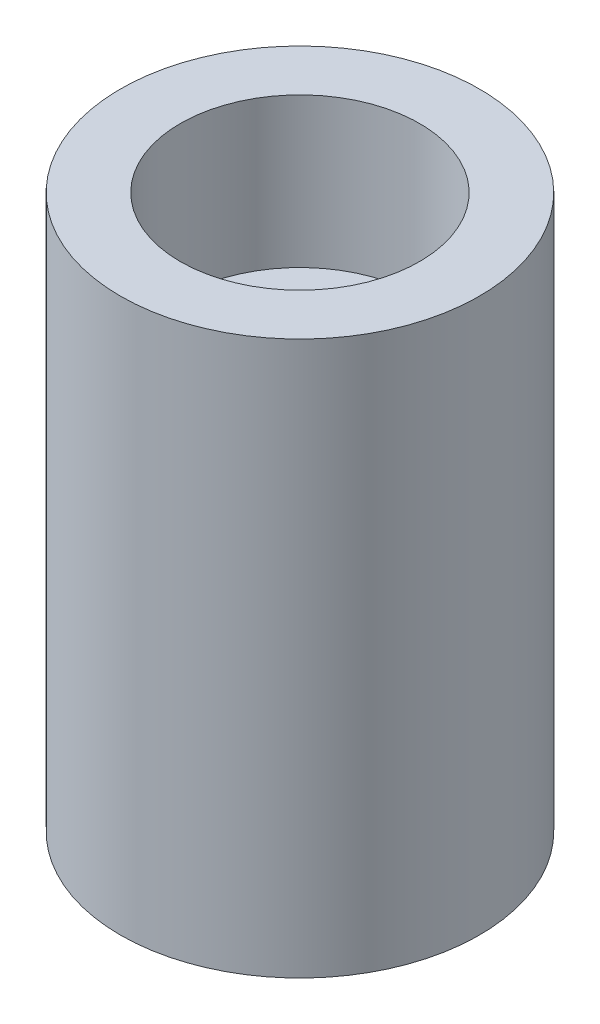
ISO-10303-21;
HEADER;
FILE_DESCRIPTION(('STEP AP214'),'2;1');
FILE_NAME('part.step','',(''),(''),'','','');
FILE_SCHEMA(('AUTOMOTIVE_DESIGN { 1 0 10303 214 1 1 1 1 }'));
ENDSEC;
DATA;
#1=APPLICATION_CONTEXT('core data for automotive mechanical design processes');
#2=APPLICATION_PROTOCOL_DEFINITION('international standard','automotive_design',2000,#1);
#3=PRODUCT_CONTEXT('',#1,'mechanical');
#4=PRODUCT('Part','Part','',(#3));
#5=PRODUCT_RELATED_PRODUCT_CATEGORY('part','',(#4));
#6=PRODUCT_DEFINITION_FORMATION('','',#4);
#7=PRODUCT_DEFINITION_CONTEXT('part definition',#1,'design');
#8=PRODUCT_DEFINITION('design','',#6,#7);
#9=PRODUCT_DEFINITION_SHAPE('','',#8);
#10=(LENGTH_UNIT() NAMED_UNIT(*) SI_UNIT(.MILLI.,.METRE.));
#11=(NAMED_UNIT(*) PLANE_ANGLE_UNIT() SI_UNIT($,.RADIAN.));
#12=(NAMED_UNIT(*) SI_UNIT($,.STERADIAN.) SOLID_ANGLE_UNIT());
#13=UNCERTAINTY_MEASURE_WITH_UNIT(LENGTH_MEASURE(1.E-05),#10,'distance_accuracy_value','');
#14=(GEOMETRIC_REPRESENTATION_CONTEXT(3) GLOBAL_UNCERTAINTY_ASSIGNED_CONTEXT((#13)) GLOBAL_UNIT_ASSIGNED_CONTEXT((#10,
#11,#12)) REPRESENTATION_CONTEXT('',''));
#15=CARTESIAN_POINT('',(0.,0.,0.));
#16=DIRECTION('',(0.,0.,1.));
#17=DIRECTION('',(1.,0.,0.));
#18=AXIS2_PLACEMENT_3D('',#15,#16,#17);
#19=CARTESIAN_POINT('',(0.,2.,0.));
#20=DIRECTION('',(0.,1.,0.));
#21=DIRECTION('',(0.,0.,1.));
#22=AXIS2_PLACEMENT_3D('',#19,#20,#21);
#23=PLANE('',#22);
#24=CARTESIAN_POINT('',(0.,2.,0.));
#25=DIRECTION('',(0.,1.,0.));
#26=DIRECTION('',(0.,0.,1.));
#27=AXIS2_PLACEMENT_3D('',#24,#25,#26);
#28=CIRCLE('',#27,1.5);
#29=CARTESIAN_POINT('',(0.,2.,1.5));
#30=VERTEX_POINT('',#29);
#31=EDGE_CURVE('E67',#30,#30,#28,.T.);
#32=ORIENTED_EDGE('',*,*,#31,.F.);
#33=EDGE_LOOP('',(#32));
#34=FACE_BOUND('',#33,.T.);
#35=CARTESIAN_POINT('',(0.,2.,0.));
#36=DIRECTION('',(0.,1.,0.));
#37=DIRECTION('',(0.,0.,1.));
#38=AXIS2_PLACEMENT_3D('',#35,#36,#37);
#39=CIRCLE('',#38,3.);
#40=CARTESIAN_POINT('',(0.,2.,3.));
#41=VERTEX_POINT('',#40);
#42=EDGE_CURVE('E11',#41,#41,#39,.F.);
#43=ORIENTED_EDGE('',*,*,#42,.F.);
#44=EDGE_LOOP('',(#43));
#45=FACE_BOUND('',#44,.T.);
#46=ADVANCED_FACE('F39',(#34,#45),#23,.T.);
#47=CARTESIAN_POINT('',(0.,18.5,0.));
#48=DIRECTION('',(0.,-1.,0.));
#49=DIRECTION('',(0.,0.,-1.));
#50=AXIS2_PLACEMENT_3D('',#47,#48,#49);
#51=CYLINDRICAL_SURFACE('',#50,6.);
#52=CARTESIAN_POINT('',(0.,18.5,0.));
#53=DIRECTION('',(0.,1.,0.));
#54=DIRECTION('',(0.,0.,1.));
#55=AXIS2_PLACEMENT_3D('',#52,#53,#54);
#56=CIRCLE('',#55,6.);
#57=CARTESIAN_POINT('',(0.,18.5,6.));
#58=VERTEX_POINT('',#57);
#59=EDGE_CURVE('E47',#58,#58,#56,.T.);
#60=ORIENTED_EDGE('',*,*,#59,.F.);
#61=EDGE_LOOP('',(#60));
#62=FACE_BOUND('',#61,.T.);
#63=CARTESIAN_POINT('',(0.,0.,0.));
#64=DIRECTION('',(0.,1.,0.));
#65=DIRECTION('',(0.,0.,1.));
#66=AXIS2_PLACEMENT_3D('',#63,#64,#65);
#67=CIRCLE('',#66,6.);
#68=CARTESIAN_POINT('',(0.,0.,6.));
#69=VERTEX_POINT('',#68);
#70=EDGE_CURVE('E52',#69,#69,#67,.T.);
#71=ORIENTED_EDGE('',*,*,#70,.T.);
#72=EDGE_LOOP('',(#71));
#73=FACE_BOUND('',#72,.T.);
#74=ADVANCED_FACE('F41',(#62,#73),#51,.T.);
#75=CARTESIAN_POINT('',(0.,18.5,0.));
#76=DIRECTION('',(0.,1.,0.));
#77=DIRECTION('',(0.,0.,1.));
#78=AXIS2_PLACEMENT_3D('',#75,#76,#77);
#79=PLANE('',#78);
#80=CARTESIAN_POINT('',(0.,18.5,0.));
#81=DIRECTION('',(0.,1.,0.));
#82=DIRECTION('',(0.,0.,1.));
#83=AXIS2_PLACEMENT_3D('',#80,#81,#82);
#84=CIRCLE('',#83,4.);
#85=CARTESIAN_POINT('',(0.,18.5,4.));
#86=VERTEX_POINT('',#85);
#87=EDGE_CURVE('E58',#86,#86,#84,.T.);
#88=ORIENTED_EDGE('',*,*,#87,.F.);
#89=EDGE_LOOP('',(#88));
#90=FACE_BOUND('',#89,.T.);
#91=ORIENTED_EDGE('',*,*,#59,.T.);
#92=EDGE_LOOP('',(#91));
#93=FACE_BOUND('',#92,.T.);
#94=ADVANCED_FACE('F90',(#90,#93),#79,.T.);
#95=CARTESIAN_POINT('',(0.,0.,0.));
#96=DIRECTION('',(0.,1.,0.));
#97=DIRECTION('',(0.,0.,1.));
#98=AXIS2_PLACEMENT_3D('',#95,#96,#97);
#99=PLANE('',#98);
#100=CARTESIAN_POINT('',(0.,0.,0.));
#101=DIRECTION('',(0.,1.,0.));
#102=DIRECTION('',(0.,0.,1.));
#103=AXIS2_PLACEMENT_3D('',#100,#101,#102);
#104=CIRCLE('',#103,1.5);
#105=CARTESIAN_POINT('',(0.,0.,1.5));
#106=VERTEX_POINT('',#105);
#107=EDGE_CURVE('E63',#106,#106,#104,.F.);
#108=ORIENTED_EDGE('',*,*,#107,.F.);
#109=EDGE_LOOP('',(#108));
#110=FACE_BOUND('',#109,.T.);
#111=ORIENTED_EDGE('',*,*,#70,.F.);
#112=EDGE_LOOP('',(#111));
#113=FACE_BOUND('',#112,.T.);
#114=ADVANCED_FACE('F86',(#110,#113),#99,.F.);
#115=CARTESIAN_POINT('',(0.,-11.3137084989848,0.));
#116=DIRECTION('',(0.,1.,0.));
#117=DIRECTION('',(0.,0.,1.));
#118=AXIS2_PLACEMENT_3D('',#115,#116,#117);
#119=CYLINDRICAL_SURFACE('',#118,4.);
#120=CARTESIAN_POINT('',(0.,13.5,0.));
#121=DIRECTION('',(0.,1.,0.));
#122=DIRECTION('',(0.,0.,1.));
#123=AXIS2_PLACEMENT_3D('',#120,#121,#122);
#124=CIRCLE('',#123,4.);
#125=CARTESIAN_POINT('',(0.,13.5,4.));
#126=VERTEX_POINT('',#125);
#127=EDGE_CURVE('E71',#126,#126,#124,.T.);
#128=ORIENTED_EDGE('',*,*,#127,.F.);
#129=EDGE_LOOP('',(#128));
#130=FACE_BOUND('',#129,.T.);
#131=ORIENTED_EDGE('',*,*,#87,.T.);
#132=EDGE_LOOP('',(#131));
#133=FACE_BOUND('',#132,.T.);
#134=ADVANCED_FACE('F82',(#130,#133),#119,.F.);
#135=CARTESIAN_POINT('',(0.,-0.00100000000000013,0.));
#136=DIRECTION('',(0.,1.,0.));
#137=DIRECTION('',(0.,0.,1.));
#138=AXIS2_PLACEMENT_3D('',#135,#136,#137);
#139=CYLINDRICAL_SURFACE('',#138,1.5);
#140=ORIENTED_EDGE('',*,*,#31,.T.);
#141=EDGE_LOOP('',(#140));
#142=FACE_BOUND('',#141,.T.);
#143=ORIENTED_EDGE('',*,*,#107,.T.);
#144=EDGE_LOOP('',(#143));
#145=FACE_BOUND('',#144,.T.);
#146=ADVANCED_FACE('F85',(#142,#145),#139,.F.);
#147=CARTESIAN_POINT('',(0.,29.8137084989848,0.));
#148=DIRECTION('',(0.,-1.,0.));
#149=DIRECTION('',(0.,0.,-1.));
#150=AXIS2_PLACEMENT_3D('',#147,#148,#149);
#151=CYLINDRICAL_SURFACE('',#150,3.);
#152=ORIENTED_EDGE('',*,*,#42,.T.);
#153=EDGE_LOOP('',(#152));
#154=FACE_BOUND('',#153,.T.);
#155=CARTESIAN_POINT('',(0.,13.5,0.));
#156=DIRECTION('',(0.,1.,0.));
#157=DIRECTION('',(0.,0.,1.));
#158=AXIS2_PLACEMENT_3D('',#155,#156,#157);
#159=CIRCLE('',#158,3.);
#160=CARTESIAN_POINT('',(0.,13.5,3.));
#161=VERTEX_POINT('',#160);
#162=EDGE_CURVE('E72',#161,#161,#159,.T.);
#163=ORIENTED_EDGE('',*,*,#162,.T.);
#164=EDGE_LOOP('',(#163));
#165=FACE_BOUND('',#164,.T.);
#166=ADVANCED_FACE('F109',(#154,#165),#151,.F.);
#167=CARTESIAN_POINT('',(0.,13.5,0.));
#168=DIRECTION('',(0.,1.,0.));
#169=DIRECTION('',(0.,0.,1.));
#170=AXIS2_PLACEMENT_3D('',#167,#168,#169);
#171=PLANE('',#170);
#172=ORIENTED_EDGE('',*,*,#162,.F.);
#173=EDGE_LOOP('',(#172));
#174=FACE_BOUND('',#173,.T.);
#175=ORIENTED_EDGE('',*,*,#127,.T.);
#176=EDGE_LOOP('',(#175));
#177=FACE_BOUND('',#176,.T.);
#178=ADVANCED_FACE('F80',(#174,#177),#171,.T.);
#179=CLOSED_SHELL('',(#46,#74,#94,#114,#134,#146,#166,#178));
#180=MANIFOLD_SOLID_BREP('B2',#179);
#181=ADVANCED_BREP_SHAPE_REPRESENTATION('',(#18,#180),#14);
#182=SHAPE_DEFINITION_REPRESENTATION(#9,#181);
ENDSEC;
END-ISO-10303-21;
